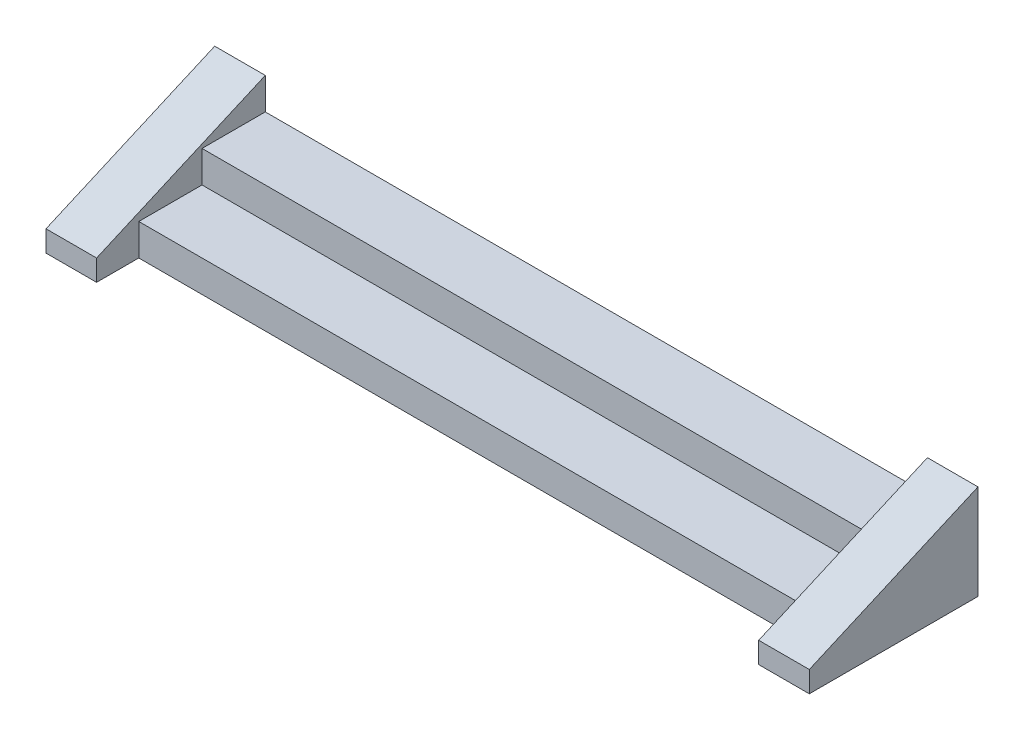
ISO-10303-21;
HEADER;
FILE_DESCRIPTION(('STEP AP214'),'2;1');
FILE_NAME('part.step','',(''),(''),'','','');
FILE_SCHEMA(('AUTOMOTIVE_DESIGN { 1 0 10303 214 1 1 1 1 }'));
ENDSEC;
DATA;
#1=APPLICATION_CONTEXT('core data for automotive mechanical design processes');
#2=APPLICATION_PROTOCOL_DEFINITION('international standard','automotive_design',2000,#1);
#3=PRODUCT_CONTEXT('',#1,'mechanical');
#4=PRODUCT('Part','Part','',(#3));
#5=PRODUCT_RELATED_PRODUCT_CATEGORY('part','',(#4));
#6=PRODUCT_DEFINITION_FORMATION('','',#4);
#7=PRODUCT_DEFINITION_CONTEXT('part definition',#1,'design');
#8=PRODUCT_DEFINITION('design','',#6,#7);
#9=PRODUCT_DEFINITION_SHAPE('','',#8);
#10=(LENGTH_UNIT() NAMED_UNIT(*) SI_UNIT(.MILLI.,.METRE.));
#11=(NAMED_UNIT(*) PLANE_ANGLE_UNIT() SI_UNIT($,.RADIAN.));
#12=(NAMED_UNIT(*) SI_UNIT($,.STERADIAN.) SOLID_ANGLE_UNIT());
#13=UNCERTAINTY_MEASURE_WITH_UNIT(LENGTH_MEASURE(1.E-05),#10,'distance_accuracy_value','');
#14=(GEOMETRIC_REPRESENTATION_CONTEXT(3) GLOBAL_UNCERTAINTY_ASSIGNED_CONTEXT((#13)) GLOBAL_UNIT_ASSIGNED_CONTEXT((#10,
#11,#12)) REPRESENTATION_CONTEXT('',''));
#15=CARTESIAN_POINT('',(0.,0.,0.));
#16=DIRECTION('',(0.,0.,1.));
#17=DIRECTION('',(1.,0.,0.));
#18=AXIS2_PLACEMENT_3D('',#15,#16,#17);
#19=CARTESIAN_POINT('',(3300.,300.,-140.14598540146));
#20=DIRECTION('',(0.,-1.,0.));
#21=DIRECTION('',(0.,0.,-1.));
#22=AXIS2_PLACEMENT_3D('',#19,#20,#21);
#23=PLANE('',#22);
#24=DIRECTION('',(0.,0.,-1.));
#25=VECTOR('',#24,1.);
#26=CARTESIAN_POINT('',(160.,300.,-140.14598540146));
#27=LINE('',#26,#25);
#28=CARTESIAN_POINT('',(160.,300.,-140.14598540146));
#29=VERTEX_POINT('',#28);
#30=CARTESIAN_POINT('',(160.,300.,-440.14598540146));
#31=VERTEX_POINT('',#30);
#32=EDGE_CURVE('E144',#29,#31,#27,.T.);
#33=ORIENTED_EDGE('',*,*,#32,.F.);
#34=DIRECTION('',(-1.,0.,0.));
#35=VECTOR('',#34,1.);
#36=CARTESIAN_POINT('',(3300.,300.,-140.14598540146));
#37=LINE('',#36,#35);
#38=CARTESIAN_POINT('',(3300.,300.,-140.14598540146));
#39=VERTEX_POINT('',#38);
#40=EDGE_CURVE('E11',#39,#29,#37,.T.);
#41=ORIENTED_EDGE('',*,*,#40,.F.);
#42=DIRECTION('',(0.,0.,1.));
#43=VECTOR('',#42,1.);
#44=CARTESIAN_POINT('',(3300.,300.,-140.14598540146));
#45=LINE('',#44,#43);
#46=CARTESIAN_POINT('',(3300.,300.,-440.14598540146));
#47=VERTEX_POINT('',#46);
#48=EDGE_CURVE('E190',#47,#39,#45,.T.);
#49=ORIENTED_EDGE('',*,*,#48,.F.);
#50=DIRECTION('',(-1.,0.,0.));
#51=VECTOR('',#50,1.);
#52=CARTESIAN_POINT('',(3300.,300.,-440.14598540146));
#53=LINE('',#52,#51);
#54=EDGE_CURVE('E48',#47,#31,#53,.T.);
#55=ORIENTED_EDGE('',*,*,#54,.T.);
#56=EDGE_LOOP('',(#33,#41,#49,#55));
#57=FACE_BOUND('',#56,.T.);
#58=ADVANCED_FACE('F34',(#57),#23,.F.);
#59=CARTESIAN_POINT('',(3300.,150.,-140.14598540146));
#60=DIRECTION('',(0.,0.,-1.));
#61=DIRECTION('',(-1.,0.,0.));
#62=AXIS2_PLACEMENT_3D('',#59,#60,#61);
#63=PLANE('',#62);
#64=DIRECTION('',(0.,1.,0.));
#65=VECTOR('',#64,1.);
#66=CARTESIAN_POINT('',(160.,150.,-140.14598540146));
#67=LINE('',#66,#65);
#68=CARTESIAN_POINT('',(160.,150.,-140.14598540146));
#69=VERTEX_POINT('',#68);
#70=EDGE_CURVE('E159',#69,#29,#67,.T.);
#71=ORIENTED_EDGE('',*,*,#70,.F.);
#72=DIRECTION('',(-1.,0.,0.));
#73=VECTOR('',#72,1.);
#74=CARTESIAN_POINT('',(3300.,150.,-140.14598540146));
#75=LINE('',#74,#73);
#76=CARTESIAN_POINT('',(3300.,150.,-140.14598540146));
#77=VERTEX_POINT('',#76);
#78=EDGE_CURVE('E41',#77,#69,#75,.T.);
#79=ORIENTED_EDGE('',*,*,#78,.F.);
#80=DIRECTION('',(0.,-1.,0.));
#81=VECTOR('',#80,1.);
#82=CARTESIAN_POINT('',(3300.,150.,-140.14598540146));
#83=LINE('',#82,#81);
#84=EDGE_CURVE('E193',#39,#77,#83,.T.);
#85=ORIENTED_EDGE('',*,*,#84,.F.);
#86=ORIENTED_EDGE('',*,*,#40,.T.);
#87=EDGE_LOOP('',(#71,#79,#85,#86));
#88=FACE_BOUND('',#87,.T.);
#89=ADVANCED_FACE('F234',(#88),#63,.F.);
#90=CARTESIAN_POINT('',(3300.,150.,159.85401459854));
#91=DIRECTION('',(0.,-1.,0.));
#92=DIRECTION('',(0.,0.,-1.));
#93=AXIS2_PLACEMENT_3D('',#90,#91,#92);
#94=PLANE('',#93);
#95=DIRECTION('',(0.,0.,-1.));
#96=VECTOR('',#95,1.);
#97=CARTESIAN_POINT('',(160.,150.,159.85401459854));
#98=LINE('',#97,#96);
#99=CARTESIAN_POINT('',(160.,150.,159.85401459854));
#100=VERTEX_POINT('',#99);
#101=EDGE_CURVE('E156',#100,#69,#98,.T.);
#102=ORIENTED_EDGE('',*,*,#101,.F.);
#103=DIRECTION('',(-1.,0.,0.));
#104=VECTOR('',#103,1.);
#105=CARTESIAN_POINT('',(3300.,150.,159.85401459854));
#106=LINE('',#105,#104);
#107=CARTESIAN_POINT('',(3300.,150.,159.85401459854));
#108=VERTEX_POINT('',#107);
#109=EDGE_CURVE('E207',#108,#100,#106,.T.);
#110=ORIENTED_EDGE('',*,*,#109,.F.);
#111=DIRECTION('',(0.,0.,1.));
#112=VECTOR('',#111,1.);
#113=CARTESIAN_POINT('',(3300.,150.,159.85401459854));
#114=LINE('',#113,#112);
#115=EDGE_CURVE('E196',#77,#108,#114,.T.);
#116=ORIENTED_EDGE('',*,*,#115,.F.);
#117=ORIENTED_EDGE('',*,*,#78,.T.);
#118=EDGE_LOOP('',(#102,#110,#116,#117));
#119=FACE_BOUND('',#118,.T.);
#120=ADVANCED_FACE('F212',(#119),#94,.F.);
#121=CARTESIAN_POINT('',(3300.,0.,159.85401459854));
#122=DIRECTION('',(0.,0.,-1.));
#123=DIRECTION('',(-1.,0.,0.));
#124=AXIS2_PLACEMENT_3D('',#121,#122,#123);
#125=PLANE('',#124);
#126=DIRECTION('',(0.,1.,0.));
#127=VECTOR('',#126,1.);
#128=CARTESIAN_POINT('',(160.,0.,159.85401459854));
#129=LINE('',#128,#127);
#130=CARTESIAN_POINT('',(160.,0.,159.85401459854));
#131=VERTEX_POINT('',#130);
#132=EDGE_CURVE('E147',#131,#100,#129,.T.);
#133=ORIENTED_EDGE('',*,*,#132,.F.);
#134=DIRECTION('',(-1.,0.,0.));
#135=VECTOR('',#134,1.);
#136=CARTESIAN_POINT('',(3300.,0.,159.85401459854));
#137=LINE('',#136,#135);
#138=CARTESIAN_POINT('',(3300.,0.,159.85401459854));
#139=VERTEX_POINT('',#138);
#140=EDGE_CURVE('E204',#139,#131,#137,.T.);
#141=ORIENTED_EDGE('',*,*,#140,.F.);
#142=DIRECTION('',(0.,-1.,0.));
#143=VECTOR('',#142,1.);
#144=CARTESIAN_POINT('',(3300.,0.,159.85401459854));
#145=LINE('',#144,#143);
#146=EDGE_CURVE('E199',#108,#139,#145,.T.);
#147=ORIENTED_EDGE('',*,*,#146,.F.);
#148=ORIENTED_EDGE('',*,*,#109,.T.);
#149=EDGE_LOOP('',(#133,#141,#147,#148));
#150=FACE_BOUND('',#149,.T.);
#151=ADVANCED_FACE('F220',(#150),#125,.F.);
#152=CARTESIAN_POINT('',(3300.,0.,-440.14598540146));
#153=DIRECTION('',(0.,1.,0.));
#154=DIRECTION('',(0.,0.,1.));
#155=AXIS2_PLACEMENT_3D('',#152,#153,#154);
#156=PLANE('',#155);
#157=ORIENTED_EDGE('',*,*,#140,.T.);
#158=DIRECTION('',(0.,0.,1.));
#159=VECTOR('',#158,1.);
#160=CARTESIAN_POINT('',(160.,0.,-440.14598540146));
#161=LINE('',#160,#159);
#162=CARTESIAN_POINT('',(160.,0.,359.85401459854));
#163=VERTEX_POINT('',#162);
#164=EDGE_CURVE('E218',#131,#163,#161,.T.);
#165=ORIENTED_EDGE('',*,*,#164,.T.);
#166=DIRECTION('',(1.,0.,0.));
#167=VECTOR('',#166,1.);
#168=CARTESIAN_POINT('',(-80.,0.,359.85401459854));
#169=LINE('',#168,#167);
#170=CARTESIAN_POINT('',(-80.,0.,359.85401459854));
#171=VERTEX_POINT('',#170);
#172=EDGE_CURVE('E145',#171,#163,#169,.T.);
#173=ORIENTED_EDGE('',*,*,#172,.F.);
#174=DIRECTION('',(0.,0.,1.));
#175=VECTOR('',#174,1.);
#176=CARTESIAN_POINT('',(-80.,0.,-440.14598540146));
#177=LINE('',#176,#175);
#178=CARTESIAN_POINT('',(-80.,0.,-440.14598540146));
#179=VERTEX_POINT('',#178);
#180=EDGE_CURVE('E129',#179,#171,#177,.T.);
#181=ORIENTED_EDGE('',*,*,#180,.F.);
#182=DIRECTION('',(-1.,0.,0.));
#183=VECTOR('',#182,1.);
#184=CARTESIAN_POINT('',(3300.,0.,-440.14598540146));
#185=LINE('',#184,#183);
#186=CARTESIAN_POINT('',(3540.,0.,-440.14598540146));
#187=VERTEX_POINT('',#186);
#188=EDGE_CURVE('E126',#187,#179,#185,.T.);
#189=ORIENTED_EDGE('',*,*,#188,.F.);
#190=DIRECTION('',(0.,0.,-1.));
#191=VECTOR('',#190,1.);
#192=CARTESIAN_POINT('',(3540.,0.,359.85401459854));
#193=LINE('',#192,#191);
#194=CARTESIAN_POINT('',(3540.,0.,359.85401459854));
#195=VERTEX_POINT('',#194);
#196=EDGE_CURVE('E171',#195,#187,#193,.T.);
#197=ORIENTED_EDGE('',*,*,#196,.F.);
#198=DIRECTION('',(-1.,0.,0.));
#199=VECTOR('',#198,1.);
#200=CARTESIAN_POINT('',(3540.,0.,359.85401459854));
#201=LINE('',#200,#199);
#202=CARTESIAN_POINT('',(3300.,0.,359.85401459854));
#203=VERTEX_POINT('',#202);
#204=EDGE_CURVE('E174',#195,#203,#201,.T.);
#205=ORIENTED_EDGE('',*,*,#204,.T.);
#206=DIRECTION('',(0.,0.,-1.));
#207=VECTOR('',#206,1.);
#208=CARTESIAN_POINT('',(3300.,0.,359.85401459854));
#209=LINE('',#208,#207);
#210=EDGE_CURVE('E167',#203,#139,#209,.T.);
#211=ORIENTED_EDGE('',*,*,#210,.T.);
#212=EDGE_LOOP('',(#157,#165,#173,#181,#189,#197,#205,#211));
#213=FACE_BOUND('',#212,.T.);
#214=ADVANCED_FACE('F223',(#213),#156,.F.);
#215=CARTESIAN_POINT('',(3300.,300.,-440.14598540146));
#216=DIRECTION('',(0.,0.,1.));
#217=DIRECTION('',(0.,-1.,0.));
#218=AXIS2_PLACEMENT_3D('',#215,#216,#217);
#219=PLANE('',#218);
#220=ORIENTED_EDGE('',*,*,#188,.T.);
#221=DIRECTION('',(0.,-1.,0.));
#222=VECTOR('',#221,1.);
#223=CARTESIAN_POINT('',(-80.,450.,-440.14598540146));
#224=LINE('',#223,#222);
#225=CARTESIAN_POINT('',(-80.,450.,-440.14598540146));
#226=VERTEX_POINT('',#225);
#227=EDGE_CURVE('E119',#226,#179,#224,.T.);
#228=ORIENTED_EDGE('',*,*,#227,.F.);
#229=DIRECTION('',(1.,0.,0.));
#230=VECTOR('',#229,1.);
#231=CARTESIAN_POINT('',(-80.,450.,-440.14598540146));
#232=LINE('',#231,#230);
#233=CARTESIAN_POINT('',(160.,450.,-440.14598540146));
#234=VERTEX_POINT('',#233);
#235=EDGE_CURVE('E123',#226,#234,#232,.T.);
#236=ORIENTED_EDGE('',*,*,#235,.T.);
#237=DIRECTION('',(0.,-1.,0.));
#238=VECTOR('',#237,1.);
#239=CARTESIAN_POINT('',(160.,450.,-440.14598540146));
#240=LINE('',#239,#238);
#241=EDGE_CURVE('E235',#234,#31,#240,.T.);
#242=ORIENTED_EDGE('',*,*,#241,.T.);
#243=ORIENTED_EDGE('',*,*,#54,.F.);
#244=DIRECTION('',(0.,1.,0.));
#245=VECTOR('',#244,1.);
#246=CARTESIAN_POINT('',(3300.,0.,-440.14598540146));
#247=LINE('',#246,#245);
#248=CARTESIAN_POINT('',(3300.,450.,-440.14598540146));
#249=VERTEX_POINT('',#248);
#250=EDGE_CURVE('E162',#47,#249,#247,.T.);
#251=ORIENTED_EDGE('',*,*,#250,.T.);
#252=DIRECTION('',(-1.,0.,0.));
#253=VECTOR('',#252,1.);
#254=CARTESIAN_POINT('',(3540.,450.,-440.14598540146));
#255=LINE('',#254,#253);
#256=CARTESIAN_POINT('',(3540.,450.,-440.14598540146));
#257=VERTEX_POINT('',#256);
#258=EDGE_CURVE('E187',#257,#249,#255,.T.);
#259=ORIENTED_EDGE('',*,*,#258,.F.);
#260=DIRECTION('',(0.,1.,0.));
#261=VECTOR('',#260,1.);
#262=CARTESIAN_POINT('',(3540.,0.,-440.14598540146));
#263=LINE('',#262,#261);
#264=EDGE_CURVE('E163',#187,#257,#263,.T.);
#265=ORIENTED_EDGE('',*,*,#264,.F.);
#266=EDGE_LOOP('',(#220,#228,#236,#242,#243,#251,#259,#265));
#267=FACE_BOUND('',#266,.T.);
#268=ADVANCED_FACE('F121',(#267),#219,.F.);
#269=CARTESIAN_POINT('',(3540.,450.,-440.14598540146));
#270=DIRECTION('',(0.,-0.916157334902189,-0.400818834019708));
#271=DIRECTION('',(0.,0.400818834019708,-0.916157334902189));
#272=AXIS2_PLACEMENT_3D('',#269,#270,#271);
#273=PLANE('',#272);
#274=DIRECTION('',(0.,-0.400818834019708,0.916157334902189));
#275=VECTOR('',#274,1.);
#276=CARTESIAN_POINT('',(3300.,450.,-440.14598540146));
#277=LINE('',#276,#275);
#278=CARTESIAN_POINT('',(3300.,100.,359.85401459854));
#279=VERTEX_POINT('',#278);
#280=EDGE_CURVE('E176',#249,#279,#277,.T.);
#281=ORIENTED_EDGE('',*,*,#280,.T.);
#282=DIRECTION('',(-1.,0.,0.));
#283=VECTOR('',#282,1.);
#284=CARTESIAN_POINT('',(3540.,100.,359.85401459854));
#285=LINE('',#284,#283);
#286=CARTESIAN_POINT('',(3540.,100.,359.85401459854));
#287=VERTEX_POINT('',#286);
#288=EDGE_CURVE('E184',#287,#279,#285,.T.);
#289=ORIENTED_EDGE('',*,*,#288,.F.);
#290=DIRECTION('',(0.,-0.400818834019708,0.916157334902189));
#291=VECTOR('',#290,1.);
#292=CARTESIAN_POINT('',(3540.,450.,-440.14598540146));
#293=LINE('',#292,#291);
#294=EDGE_CURVE('E166',#257,#287,#293,.T.);
#295=ORIENTED_EDGE('',*,*,#294,.F.);
#296=ORIENTED_EDGE('',*,*,#258,.T.);
#297=EDGE_LOOP('',(#281,#289,#295,#296));
#298=FACE_BOUND('',#297,.T.);
#299=ADVANCED_FACE('F268',(#298),#273,.F.);
#300=CARTESIAN_POINT('',(3540.,100.,359.85401459854));
#301=DIRECTION('',(0.,0.,-1.));
#302=DIRECTION('',(-1.,0.,0.));
#303=AXIS2_PLACEMENT_3D('',#300,#301,#302);
#304=PLANE('',#303);
#305=DIRECTION('',(0.,-1.,0.));
#306=VECTOR('',#305,1.);
#307=CARTESIAN_POINT('',(3300.,100.,359.85401459854));
#308=LINE('',#307,#306);
#309=EDGE_CURVE('E178',#279,#203,#308,.T.);
#310=ORIENTED_EDGE('',*,*,#309,.T.);
#311=ORIENTED_EDGE('',*,*,#204,.F.);
#312=DIRECTION('',(0.,-1.,0.));
#313=VECTOR('',#312,1.);
#314=CARTESIAN_POINT('',(3540.,100.,359.85401459854));
#315=LINE('',#314,#313);
#316=EDGE_CURVE('E169',#287,#195,#315,.T.);
#317=ORIENTED_EDGE('',*,*,#316,.F.);
#318=ORIENTED_EDGE('',*,*,#288,.T.);
#319=EDGE_LOOP('',(#310,#311,#317,#318));
#320=FACE_BOUND('',#319,.T.);
#321=ADVANCED_FACE('F271',(#320),#304,.F.);
#322=CARTESIAN_POINT('',(3540.,0.,0.));
#323=DIRECTION('',(-1.,0.,0.));
#324=DIRECTION('',(0.,0.,1.));
#325=AXIS2_PLACEMENT_3D('',#322,#323,#324);
#326=PLANE('',#325);
#327=ORIENTED_EDGE('',*,*,#264,.T.);
#328=ORIENTED_EDGE('',*,*,#294,.T.);
#329=ORIENTED_EDGE('',*,*,#316,.T.);
#330=ORIENTED_EDGE('',*,*,#196,.T.);
#331=EDGE_LOOP('',(#327,#328,#329,#330));
#332=FACE_BOUND('',#331,.T.);
#333=ADVANCED_FACE('F275',(#332),#326,.F.);
#334=CARTESIAN_POINT('',(3300.,0.,0.));
#335=DIRECTION('',(-1.,0.,0.));
#336=DIRECTION('',(0.,0.,1.));
#337=AXIS2_PLACEMENT_3D('',#334,#335,#336);
#338=PLANE('',#337);
#339=ORIENTED_EDGE('',*,*,#250,.F.);
#340=ORIENTED_EDGE('',*,*,#48,.T.);
#341=ORIENTED_EDGE('',*,*,#84,.T.);
#342=ORIENTED_EDGE('',*,*,#115,.T.);
#343=ORIENTED_EDGE('',*,*,#146,.T.);
#344=ORIENTED_EDGE('',*,*,#210,.F.);
#345=ORIENTED_EDGE('',*,*,#309,.F.);
#346=ORIENTED_EDGE('',*,*,#280,.F.);
#347=EDGE_LOOP('',(#339,#340,#341,#342,#343,#344,#345,#346));
#348=FACE_BOUND('',#347,.T.);
#349=ADVANCED_FACE('F231',(#348),#338,.T.);
#350=CARTESIAN_POINT('',(160.,0.,0.));
#351=DIRECTION('',(-1.,0.,0.));
#352=DIRECTION('',(0.,0.,1.));
#353=AXIS2_PLACEMENT_3D('',#350,#351,#352);
#354=PLANE('',#353);
#355=ORIENTED_EDGE('',*,*,#70,.T.);
#356=ORIENTED_EDGE('',*,*,#32,.T.);
#357=ORIENTED_EDGE('',*,*,#241,.F.);
#358=DIRECTION('',(0.,0.400818834019708,-0.916157334902189));
#359=VECTOR('',#358,1.);
#360=CARTESIAN_POINT('',(160.,100.,359.85401459854));
#361=LINE('',#360,#359);
#362=CARTESIAN_POINT('',(160.,100.,359.85401459854));
#363=VERTEX_POINT('',#362);
#364=EDGE_CURVE('E143',#363,#234,#361,.T.);
#365=ORIENTED_EDGE('',*,*,#364,.F.);
#366=DIRECTION('',(0.,1.,0.));
#367=VECTOR('',#366,1.);
#368=CARTESIAN_POINT('',(160.,0.,359.85401459854));
#369=LINE('',#368,#367);
#370=EDGE_CURVE('E139',#163,#363,#369,.T.);
#371=ORIENTED_EDGE('',*,*,#370,.F.);
#372=ORIENTED_EDGE('',*,*,#164,.F.);
#373=ORIENTED_EDGE('',*,*,#132,.T.);
#374=ORIENTED_EDGE('',*,*,#101,.T.);
#375=EDGE_LOOP('',(#355,#356,#357,#365,#371,#372,#373,#374));
#376=FACE_BOUND('',#375,.T.);
#377=ADVANCED_FACE('F215',(#376),#354,.F.);
#378=CARTESIAN_POINT('',(-80.,100.,359.85401459854));
#379=DIRECTION('',(0.,-0.916157334902189,-0.400818834019708));
#380=DIRECTION('',(0.,0.400818834019708,-0.916157334902189));
#381=AXIS2_PLACEMENT_3D('',#378,#379,#380);
#382=PLANE('',#381);
#383=ORIENTED_EDGE('',*,*,#364,.T.);
#384=ORIENTED_EDGE('',*,*,#235,.F.);
#385=DIRECTION('',(0.,0.400818834019708,-0.916157334902189));
#386=VECTOR('',#385,1.);
#387=CARTESIAN_POINT('',(-80.,100.,359.85401459854));
#388=LINE('',#387,#386);
#389=CARTESIAN_POINT('',(-80.,100.,359.85401459854));
#390=VERTEX_POINT('',#389);
#391=EDGE_CURVE('E130',#390,#226,#388,.T.);
#392=ORIENTED_EDGE('',*,*,#391,.F.);
#393=DIRECTION('',(1.,0.,0.));
#394=VECTOR('',#393,1.);
#395=CARTESIAN_POINT('',(-80.,100.,359.85401459854));
#396=LINE('',#395,#394);
#397=EDGE_CURVE('E150',#390,#363,#396,.T.);
#398=ORIENTED_EDGE('',*,*,#397,.T.);
#399=EDGE_LOOP('',(#383,#384,#392,#398));
#400=FACE_BOUND('',#399,.T.);
#401=ADVANCED_FACE('F141',(#400),#382,.F.);
#402=CARTESIAN_POINT('',(-80.,0.,359.85401459854));
#403=DIRECTION('',(0.,0.,-1.));
#404=DIRECTION('',(-1.,0.,0.));
#405=AXIS2_PLACEMENT_3D('',#402,#403,#404);
#406=PLANE('',#405);
#407=ORIENTED_EDGE('',*,*,#370,.T.);
#408=ORIENTED_EDGE('',*,*,#397,.F.);
#409=DIRECTION('',(0.,1.,0.));
#410=VECTOR('',#409,1.);
#411=CARTESIAN_POINT('',(-80.,0.,359.85401459854));
#412=LINE('',#411,#410);
#413=EDGE_CURVE('E135',#171,#390,#412,.T.);
#414=ORIENTED_EDGE('',*,*,#413,.F.);
#415=ORIENTED_EDGE('',*,*,#172,.T.);
#416=EDGE_LOOP('',(#407,#408,#414,#415));
#417=FACE_BOUND('',#416,.T.);
#418=ADVANCED_FACE('F243',(#417),#406,.F.);
#419=CARTESIAN_POINT('',(-80.,0.,0.));
#420=DIRECTION('',(-1.,0.,0.));
#421=DIRECTION('',(0.,0.,1.));
#422=AXIS2_PLACEMENT_3D('',#419,#420,#421);
#423=PLANE('',#422);
#424=ORIENTED_EDGE('',*,*,#391,.T.);
#425=ORIENTED_EDGE('',*,*,#227,.T.);
#426=ORIENTED_EDGE('',*,*,#180,.T.);
#427=ORIENTED_EDGE('',*,*,#413,.T.);
#428=EDGE_LOOP('',(#424,#425,#426,#427));
#429=FACE_BOUND('',#428,.T.);
#430=ADVANCED_FACE('F133',(#429),#423,.T.);
#431=CLOSED_SHELL('',(#58,#89,#120,#151,#214,#268,#299,#321,#333,#349,#377,#401,#418,#430));
#432=MANIFOLD_SOLID_BREP('B2',#431);
#433=ADVANCED_BREP_SHAPE_REPRESENTATION('',(#18,#432),#14);
#434=SHAPE_DEFINITION_REPRESENTATION(#9,#433);
ENDSEC;
END-ISO-10303-21;
